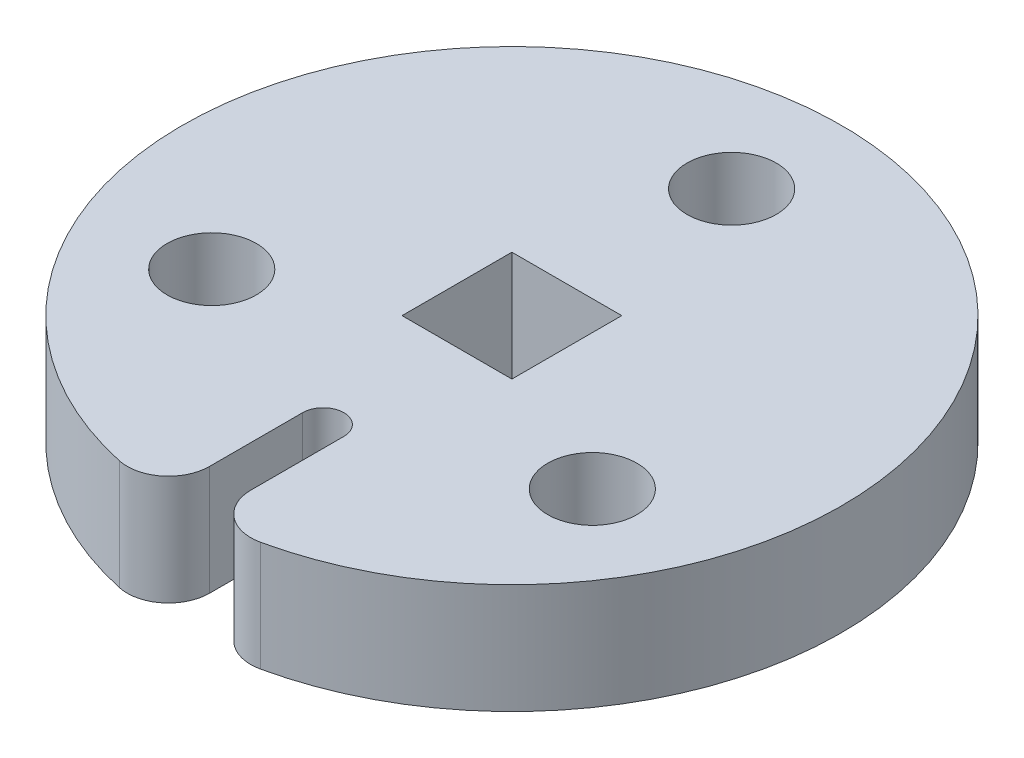
ISO-10303-21;
HEADER;
FILE_DESCRIPTION(('STEP AP214'),'2;1');
FILE_NAME('part.step','',(''),(''),'','','');
FILE_SCHEMA(('AUTOMOTIVE_DESIGN { 1 0 10303 214 1 1 1 1 }'));
ENDSEC;
DATA;
#1=APPLICATION_CONTEXT('core data for automotive mechanical design processes');
#2=APPLICATION_PROTOCOL_DEFINITION('international standard','automotive_design',2000,#1);
#3=PRODUCT_CONTEXT('',#1,'mechanical');
#4=PRODUCT('Part','Part','',(#3));
#5=PRODUCT_RELATED_PRODUCT_CATEGORY('part','',(#4));
#6=PRODUCT_DEFINITION_FORMATION('','',#4);
#7=PRODUCT_DEFINITION_CONTEXT('part definition',#1,'design');
#8=PRODUCT_DEFINITION('design','',#6,#7);
#9=PRODUCT_DEFINITION_SHAPE('','',#8);
#10=(LENGTH_UNIT() NAMED_UNIT(*) SI_UNIT(.MILLI.,.METRE.));
#11=(NAMED_UNIT(*) PLANE_ANGLE_UNIT() SI_UNIT($,.RADIAN.));
#12=(NAMED_UNIT(*) SI_UNIT($,.STERADIAN.) SOLID_ANGLE_UNIT());
#13=UNCERTAINTY_MEASURE_WITH_UNIT(LENGTH_MEASURE(1.E-05),#10,'distance_accuracy_value','');
#14=(GEOMETRIC_REPRESENTATION_CONTEXT(3) GLOBAL_UNCERTAINTY_ASSIGNED_CONTEXT((#13)) GLOBAL_UNIT_ASSIGNED_CONTEXT((#10,
#11,#12)) REPRESENTATION_CONTEXT('',''));
#15=CARTESIAN_POINT('',(0.,0.,0.));
#16=DIRECTION('',(0.,0.,1.));
#17=DIRECTION('',(1.,0.,0.));
#18=AXIS2_PLACEMENT_3D('',#15,#16,#17);
#19=CARTESIAN_POINT('',(0.,6.35,10.903378281309));
#20=DIRECTION('',(0.,1.,0.));
#21=DIRECTION('',(0.,0.,1.));
#22=AXIS2_PLACEMENT_3D('',#19,#20,#21);
#23=PLANE('',#22);
#24=CARTESIAN_POINT('',(10.9985226280624,6.35,6.35));
#25=DIRECTION('',(0.,1.,0.));
#26=DIRECTION('',(0.,0.,1.));
#27=AXIS2_PLACEMENT_3D('',#24,#25,#26);
#28=CIRCLE('',#27,2.5796875);
#29=CARTESIAN_POINT('',(10.9985226280624,6.35,8.9296875));
#30=VERTEX_POINT('',#29);
#31=EDGE_CURVE('E139',#30,#30,#28,.T.);
#32=ORIENTED_EDGE('',*,*,#31,.F.);
#33=EDGE_LOOP('',(#32));
#34=FACE_BOUND('',#33,.T.);
#35=CARTESIAN_POINT('',(0.,6.35,10.903378281309));
#36=DIRECTION('',(0.,-1.,0.));
#37=DIRECTION('',(0.,0.,1.));
#38=AXIS2_PLACEMENT_3D('',#35,#36,#37);
#39=CIRCLE('',#38,1.190625);
#40=CARTESIAN_POINT('',(-1.190625,6.35,10.903378281309));
#41=VERTEX_POINT('',#40);
#42=CARTESIAN_POINT('',(1.190625,6.35,10.903378281309));
#43=VERTEX_POINT('',#42);
#44=EDGE_CURVE('E155',#41,#43,#39,.T.);
#45=ORIENTED_EDGE('',*,*,#44,.T.);
#46=DIRECTION('',(0.,0.,1.));
#47=VECTOR('',#46,1.);
#48=CARTESIAN_POINT('',(1.190625,6.35,10.903378281309));
#49=LINE('',#48,#47);
#50=CARTESIAN_POINT('',(1.190625,6.35,16.281552000558));
#51=VERTEX_POINT('',#50);
#52=EDGE_CURVE('E158',#43,#51,#49,.T.);
#53=ORIENTED_EDGE('',*,*,#52,.T.);
#54=CARTESIAN_POINT('',(3.571875,6.35,16.281552000558));
#55=DIRECTION('',(0.,1.,0.));
#56=DIRECTION('',(0.,0.,1.));
#57=AXIS2_PLACEMENT_3D('',#54,#55,#56);
#58=CIRCLE('',#57,2.38125);
#59=CARTESIAN_POINT('',(4.08214285714286,6.35,18.6074880006377));
#60=VERTEX_POINT('',#59);
#61=EDGE_CURVE('E161',#51,#60,#58,.T.);
#62=ORIENTED_EDGE('',*,*,#61,.T.);
#63=CARTESIAN_POINT('',(0.,6.35,0.));
#64=DIRECTION('',(0.,1.,0.));
#65=DIRECTION('',(0.,0.,1.));
#66=AXIS2_PLACEMENT_3D('',#63,#64,#65);
#67=CIRCLE('',#66,19.05);
#68=CARTESIAN_POINT('',(-4.08214285714286,6.35,18.6074880006377));
#69=VERTEX_POINT('',#68);
#70=EDGE_CURVE('E163',#60,#69,#67,.T.);
#71=ORIENTED_EDGE('',*,*,#70,.T.);
#72=CARTESIAN_POINT('',(-3.571875,6.35,16.281552000558));
#73=DIRECTION('',(0.,1.,0.));
#74=DIRECTION('',(0.,0.,-1.));
#75=AXIS2_PLACEMENT_3D('',#72,#73,#74);
#76=CIRCLE('',#75,2.38125);
#77=CARTESIAN_POINT('',(-1.190625,6.35,16.281552000558));
#78=VERTEX_POINT('',#77);
#79=EDGE_CURVE('E165',#69,#78,#76,.T.);
#80=ORIENTED_EDGE('',*,*,#79,.T.);
#81=DIRECTION('',(0.,0.,-1.));
#82=VECTOR('',#81,1.);
#83=CARTESIAN_POINT('',(-1.190625,6.35,10.903378281309));
#84=LINE('',#83,#82);
#85=EDGE_CURVE('E167',#78,#41,#84,.T.);
#86=ORIENTED_EDGE('',*,*,#85,.T.);
#87=EDGE_LOOP('',(#45,#53,#62,#71,#80,#86));
#88=FACE_BOUND('',#87,.T.);
#89=CARTESIAN_POINT('',(0.,6.35,-12.7));
#90=DIRECTION('',(0.,1.,0.));
#91=DIRECTION('',(0.,0.,1.));
#92=AXIS2_PLACEMENT_3D('',#89,#90,#91);
#93=CIRCLE('',#92,2.5796875);
#94=CARTESIAN_POINT('',(0.,6.35,-10.1203125));
#95=VERTEX_POINT('',#94);
#96=EDGE_CURVE('E149',#95,#95,#93,.T.);
#97=ORIENTED_EDGE('',*,*,#96,.F.);
#98=EDGE_LOOP('',(#97));
#99=FACE_BOUND('',#98,.T.);
#100=DIRECTION('',(-1.,0.,0.));
#101=VECTOR('',#100,1.);
#102=CARTESIAN_POINT('',(3.175,6.35,-3.175));
#103=LINE('',#102,#101);
#104=CARTESIAN_POINT('',(3.175,6.35,-3.175));
#105=VERTEX_POINT('',#104);
#106=CARTESIAN_POINT('',(-3.175,6.35,-3.175));
#107=VERTEX_POINT('',#106);
#108=EDGE_CURVE('E118',#105,#107,#103,.T.);
#109=ORIENTED_EDGE('',*,*,#108,.F.);
#110=DIRECTION('',(0.,0.,-1.));
#111=VECTOR('',#110,1.);
#112=CARTESIAN_POINT('',(3.175,6.35,3.175));
#113=LINE('',#112,#111);
#114=CARTESIAN_POINT('',(3.175,6.35,3.175));
#115=VERTEX_POINT('',#114);
#116=EDGE_CURVE('E110',#115,#105,#113,.T.);
#117=ORIENTED_EDGE('',*,*,#116,.F.);
#118=DIRECTION('',(1.,0.,0.));
#119=VECTOR('',#118,1.);
#120=CARTESIAN_POINT('',(3.175,6.35,3.175));
#121=LINE('',#120,#119);
#122=CARTESIAN_POINT('',(-3.175,6.35,3.175));
#123=VERTEX_POINT('',#122);
#124=EDGE_CURVE('E133',#123,#115,#121,.T.);
#125=ORIENTED_EDGE('',*,*,#124,.F.);
#126=DIRECTION('',(0.,0.,1.));
#127=VECTOR('',#126,1.);
#128=CARTESIAN_POINT('',(-3.175,6.35,3.175));
#129=LINE('',#128,#127);
#130=EDGE_CURVE('E131',#107,#123,#129,.T.);
#131=ORIENTED_EDGE('',*,*,#130,.F.);
#132=EDGE_LOOP('',(#109,#117,#125,#131));
#133=FACE_BOUND('',#132,.T.);
#134=CARTESIAN_POINT('',(-10.9985226280624,6.35,6.35000000000001));
#135=DIRECTION('',(0.,1.,0.));
#136=DIRECTION('',(0.,0.,1.));
#137=AXIS2_PLACEMENT_3D('',#134,#135,#136);
#138=CIRCLE('',#137,2.5796875);
#139=CARTESIAN_POINT('',(-10.9985226280624,6.35,8.92968750000001));
#140=VERTEX_POINT('',#139);
#141=EDGE_CURVE('E267',#140,#140,#138,.T.);
#142=ORIENTED_EDGE('',*,*,#141,.F.);
#143=EDGE_LOOP('',(#142));
#144=FACE_BOUND('',#143,.T.);
#145=ADVANCED_FACE('F33',(#34,#88,#99,#133,#144),#23,.T.);
#146=CARTESIAN_POINT('',(0.,0.,10.903378281309));
#147=DIRECTION('',(0.,1.,0.));
#148=DIRECTION('',(0.,0.,1.));
#149=AXIS2_PLACEMENT_3D('',#146,#147,#148);
#150=PLANE('',#149);
#151=CARTESIAN_POINT('',(0.,0.,-12.7));
#152=DIRECTION('',(0.,1.,0.));
#153=DIRECTION('',(0.,0.,1.));
#154=AXIS2_PLACEMENT_3D('',#151,#152,#153);
#155=CIRCLE('',#154,2.5796875);
#156=CARTESIAN_POINT('',(0.,0.,-10.1203125));
#157=VERTEX_POINT('',#156);
#158=EDGE_CURVE('E126',#157,#157,#155,.T.);
#159=ORIENTED_EDGE('',*,*,#158,.T.);
#160=EDGE_LOOP('',(#159));
#161=FACE_BOUND('',#160,.T.);
#162=CARTESIAN_POINT('',(0.,0.,10.903378281309));
#163=DIRECTION('',(0.,-1.,0.));
#164=DIRECTION('',(0.,0.,1.));
#165=AXIS2_PLACEMENT_3D('',#162,#163,#164);
#166=CIRCLE('',#165,1.190625);
#167=CARTESIAN_POINT('',(-1.190625,0.,10.903378281309));
#168=VERTEX_POINT('',#167);
#169=CARTESIAN_POINT('',(1.190625,0.,10.903378281309));
#170=VERTEX_POINT('',#169);
#171=EDGE_CURVE('E152',#168,#170,#166,.T.);
#172=ORIENTED_EDGE('',*,*,#171,.F.);
#173=DIRECTION('',(0.,0.,-1.));
#174=VECTOR('',#173,1.);
#175=CARTESIAN_POINT('',(-1.190625,0.,10.903378281309));
#176=LINE('',#175,#174);
#177=CARTESIAN_POINT('',(-1.190625,0.,16.281552000558));
#178=VERTEX_POINT('',#177);
#179=EDGE_CURVE('E159',#178,#168,#176,.T.);
#180=ORIENTED_EDGE('',*,*,#179,.F.);
#181=CARTESIAN_POINT('',(-3.571875,0.,16.281552000558));
#182=DIRECTION('',(0.,1.,0.));
#183=DIRECTION('',(0.,0.,-1.));
#184=AXIS2_PLACEMENT_3D('',#181,#182,#183);
#185=CIRCLE('',#184,2.38125);
#186=CARTESIAN_POINT('',(-4.08214285714286,0.,18.6074880006377));
#187=VERTEX_POINT('',#186);
#188=EDGE_CURVE('E178',#187,#178,#185,.T.);
#189=ORIENTED_EDGE('',*,*,#188,.F.);
#190=CARTESIAN_POINT('',(0.,0.,0.));
#191=DIRECTION('',(0.,1.,0.));
#192=DIRECTION('',(0.,0.,1.));
#193=AXIS2_PLACEMENT_3D('',#190,#191,#192);
#194=CIRCLE('',#193,19.05);
#195=CARTESIAN_POINT('',(4.08214285714286,0.,18.6074880006377));
#196=VERTEX_POINT('',#195);
#197=EDGE_CURVE('E176',#196,#187,#194,.T.);
#198=ORIENTED_EDGE('',*,*,#197,.F.);
#199=CARTESIAN_POINT('',(3.571875,0.,16.281552000558));
#200=DIRECTION('',(0.,1.,0.));
#201=DIRECTION('',(0.,0.,1.));
#202=AXIS2_PLACEMENT_3D('',#199,#200,#201);
#203=CIRCLE('',#202,2.38125);
#204=CARTESIAN_POINT('',(1.190625,0.,16.281552000558));
#205=VERTEX_POINT('',#204);
#206=EDGE_CURVE('E174',#205,#196,#203,.T.);
#207=ORIENTED_EDGE('',*,*,#206,.F.);
#208=DIRECTION('',(0.,0.,1.));
#209=VECTOR('',#208,1.);
#210=CARTESIAN_POINT('',(1.190625,0.,10.903378281309));
#211=LINE('',#210,#209);
#212=EDGE_CURVE('E172',#170,#205,#211,.T.);
#213=ORIENTED_EDGE('',*,*,#212,.F.);
#214=EDGE_LOOP('',(#172,#180,#189,#198,#207,#213));
#215=FACE_BOUND('',#214,.T.);
#216=DIRECTION('',(0.,0.,-1.));
#217=VECTOR('',#216,1.);
#218=CARTESIAN_POINT('',(3.175,0.,3.175));
#219=LINE('',#218,#217);
#220=CARTESIAN_POINT('',(3.175,0.,3.175));
#221=VERTEX_POINT('',#220);
#222=CARTESIAN_POINT('',(3.175,0.,-3.175));
#223=VERTEX_POINT('',#222);
#224=EDGE_CURVE('E56',#221,#223,#219,.T.);
#225=ORIENTED_EDGE('',*,*,#224,.T.);
#226=DIRECTION('',(-1.,0.,0.));
#227=VECTOR('',#226,1.);
#228=CARTESIAN_POINT('',(3.175,0.,-3.175));
#229=LINE('',#228,#227);
#230=CARTESIAN_POINT('',(-3.175,0.,-3.175));
#231=VERTEX_POINT('',#230);
#232=EDGE_CURVE('E125',#223,#231,#229,.T.);
#233=ORIENTED_EDGE('',*,*,#232,.T.);
#234=DIRECTION('',(0.,0.,1.));
#235=VECTOR('',#234,1.);
#236=CARTESIAN_POINT('',(-3.175,0.,3.175));
#237=LINE('',#236,#235);
#238=CARTESIAN_POINT('',(-3.175,0.,3.175));
#239=VERTEX_POINT('',#238);
#240=EDGE_CURVE('E141',#231,#239,#237,.T.);
#241=ORIENTED_EDGE('',*,*,#240,.T.);
#242=DIRECTION('',(1.,0.,0.));
#243=VECTOR('',#242,1.);
#244=CARTESIAN_POINT('',(3.175,0.,3.175));
#245=LINE('',#244,#243);
#246=EDGE_CURVE('E119',#239,#221,#245,.T.);
#247=ORIENTED_EDGE('',*,*,#246,.T.);
#248=EDGE_LOOP('',(#225,#233,#241,#247));
#249=FACE_BOUND('',#248,.T.);
#250=CARTESIAN_POINT('',(10.9985226280624,0.,6.35));
#251=DIRECTION('',(0.,1.,0.));
#252=DIRECTION('',(0.,0.,1.));
#253=AXIS2_PLACEMENT_3D('',#250,#251,#252);
#254=CIRCLE('',#253,2.5796875);
#255=CARTESIAN_POINT('',(10.9985226280624,0.,8.9296875));
#256=VERTEX_POINT('',#255);
#257=EDGE_CURVE('E273',#256,#256,#254,.T.);
#258=ORIENTED_EDGE('',*,*,#257,.T.);
#259=EDGE_LOOP('',(#258));
#260=FACE_BOUND('',#259,.T.);
#261=CARTESIAN_POINT('',(-10.9985226280624,0.,6.35000000000001));
#262=DIRECTION('',(0.,1.,0.));
#263=DIRECTION('',(0.,0.,1.));
#264=AXIS2_PLACEMENT_3D('',#261,#262,#263);
#265=CIRCLE('',#264,2.5796875);
#266=CARTESIAN_POINT('',(-10.9985226280624,0.,8.92968750000001));
#267=VERTEX_POINT('',#266);
#268=EDGE_CURVE('E270',#267,#267,#265,.T.);
#269=ORIENTED_EDGE('',*,*,#268,.T.);
#270=EDGE_LOOP('',(#269));
#271=FACE_BOUND('',#270,.T.);
#272=ADVANCED_FACE('F202',(#161,#215,#249,#260,#271),#150,.F.);
#273=CARTESIAN_POINT('',(0.,6.35,10.903378281309));
#274=DIRECTION('',(0.,-1.,0.));
#275=DIRECTION('',(0.,0.,-1.));
#276=AXIS2_PLACEMENT_3D('',#273,#274,#275);
#277=CYLINDRICAL_SURFACE('',#276,1.190625);
#278=ORIENTED_EDGE('',*,*,#171,.T.);
#279=DIRECTION('',(0.,-1.,0.));
#280=VECTOR('',#279,1.);
#281=CARTESIAN_POINT('',(1.190625,6.35,10.903378281309));
#282=LINE('',#281,#280);
#283=EDGE_CURVE('E11',#43,#170,#282,.T.);
#284=ORIENTED_EDGE('',*,*,#283,.F.);
#285=ORIENTED_EDGE('',*,*,#44,.F.);
#286=DIRECTION('',(0.,-1.,0.));
#287=VECTOR('',#286,1.);
#288=CARTESIAN_POINT('',(-1.190625,6.35,10.903378281309));
#289=LINE('',#288,#287);
#290=EDGE_CURVE('E169',#41,#168,#289,.T.);
#291=ORIENTED_EDGE('',*,*,#290,.T.);
#292=EDGE_LOOP('',(#278,#284,#285,#291));
#293=FACE_BOUND('',#292,.T.);
#294=ADVANCED_FACE('F35',(#293),#277,.F.);
#295=CARTESIAN_POINT('',(1.190625,6.35,10.903378281309));
#296=DIRECTION('',(1.,0.,0.));
#297=DIRECTION('',(0.,0.,-1.));
#298=AXIS2_PLACEMENT_3D('',#295,#296,#297);
#299=PLANE('',#298);
#300=ORIENTED_EDGE('',*,*,#212,.T.);
#301=DIRECTION('',(0.,-1.,0.));
#302=VECTOR('',#301,1.);
#303=CARTESIAN_POINT('',(1.190625,6.35,16.281552000558));
#304=LINE('',#303,#302);
#305=EDGE_CURVE('E41',#51,#205,#304,.T.);
#306=ORIENTED_EDGE('',*,*,#305,.F.);
#307=ORIENTED_EDGE('',*,*,#52,.F.);
#308=ORIENTED_EDGE('',*,*,#283,.T.);
#309=EDGE_LOOP('',(#300,#306,#307,#308));
#310=FACE_BOUND('',#309,.T.);
#311=ADVANCED_FACE('F220',(#310),#299,.F.);
#312=CARTESIAN_POINT('',(3.571875,6.35,16.281552000558));
#313=DIRECTION('',(0.,-1.,0.));
#314=DIRECTION('',(0.,0.,-1.));
#315=AXIS2_PLACEMENT_3D('',#312,#313,#314);
#316=CYLINDRICAL_SURFACE('',#315,2.38125);
#317=ORIENTED_EDGE('',*,*,#206,.T.);
#318=DIRECTION('',(0.,-1.,0.));
#319=VECTOR('',#318,1.);
#320=CARTESIAN_POINT('',(4.08214285714286,6.35,18.6074880006377));
#321=LINE('',#320,#319);
#322=EDGE_CURVE('E189',#60,#196,#321,.T.);
#323=ORIENTED_EDGE('',*,*,#322,.F.);
#324=ORIENTED_EDGE('',*,*,#61,.F.);
#325=ORIENTED_EDGE('',*,*,#305,.T.);
#326=EDGE_LOOP('',(#317,#323,#324,#325));
#327=FACE_BOUND('',#326,.T.);
#328=ADVANCED_FACE('F196',(#327),#316,.T.);
#329=CARTESIAN_POINT('',(0.,6.35,0.));
#330=DIRECTION('',(0.,-1.,0.));
#331=DIRECTION('',(0.,0.,-1.));
#332=AXIS2_PLACEMENT_3D('',#329,#330,#331);
#333=CYLINDRICAL_SURFACE('',#332,19.05);
#334=ORIENTED_EDGE('',*,*,#197,.T.);
#335=DIRECTION('',(0.,-1.,0.));
#336=VECTOR('',#335,1.);
#337=CARTESIAN_POINT('',(-4.08214285714286,6.35,18.6074880006377));
#338=LINE('',#337,#336);
#339=EDGE_CURVE('E186',#69,#187,#338,.T.);
#340=ORIENTED_EDGE('',*,*,#339,.F.);
#341=ORIENTED_EDGE('',*,*,#70,.F.);
#342=ORIENTED_EDGE('',*,*,#322,.T.);
#343=EDGE_LOOP('',(#334,#340,#341,#342));
#344=FACE_BOUND('',#343,.T.);
#345=ADVANCED_FACE('F208',(#344),#333,.T.);
#346=CARTESIAN_POINT('',(-3.571875,6.35,16.281552000558));
#347=DIRECTION('',(0.,-1.,0.));
#348=DIRECTION('',(0.,0.,-1.));
#349=AXIS2_PLACEMENT_3D('',#346,#347,#348);
#350=CYLINDRICAL_SURFACE('',#349,2.38125);
#351=ORIENTED_EDGE('',*,*,#188,.T.);
#352=DIRECTION('',(0.,-1.,0.));
#353=VECTOR('',#352,1.);
#354=CARTESIAN_POINT('',(-1.190625,6.35,16.281552000558));
#355=LINE('',#354,#353);
#356=EDGE_CURVE('E183',#78,#178,#355,.T.);
#357=ORIENTED_EDGE('',*,*,#356,.F.);
#358=ORIENTED_EDGE('',*,*,#79,.F.);
#359=ORIENTED_EDGE('',*,*,#339,.T.);
#360=EDGE_LOOP('',(#351,#357,#358,#359));
#361=FACE_BOUND('',#360,.T.);
#362=ADVANCED_FACE('F212',(#361),#350,.T.);
#363=CARTESIAN_POINT('',(-1.190625,6.35,10.903378281309));
#364=DIRECTION('',(-1.,0.,0.));
#365=DIRECTION('',(0.,0.,1.));
#366=AXIS2_PLACEMENT_3D('',#363,#364,#365);
#367=PLANE('',#366);
#368=ORIENTED_EDGE('',*,*,#179,.T.);
#369=ORIENTED_EDGE('',*,*,#290,.F.);
#370=ORIENTED_EDGE('',*,*,#85,.F.);
#371=ORIENTED_EDGE('',*,*,#356,.T.);
#372=EDGE_LOOP('',(#368,#369,#370,#371));
#373=FACE_BOUND('',#372,.T.);
#374=ADVANCED_FACE('F223',(#373),#367,.F.);
#375=CARTESIAN_POINT('',(0.,6.35,-12.7));
#376=DIRECTION('',(0.,-1.,0.));
#377=DIRECTION('',(0.,0.,-1.));
#378=AXIS2_PLACEMENT_3D('',#375,#376,#377);
#379=CYLINDRICAL_SURFACE('',#378,2.5796875);
#380=ORIENTED_EDGE('',*,*,#96,.T.);
#381=EDGE_LOOP('',(#380));
#382=FACE_BOUND('',#381,.T.);
#383=ORIENTED_EDGE('',*,*,#158,.F.);
#384=EDGE_LOOP('',(#383));
#385=FACE_BOUND('',#384,.T.);
#386=ADVANCED_FACE('F225',(#382,#385),#379,.F.);
#387=CARTESIAN_POINT('',(3.175,6.35,3.175));
#388=DIRECTION('',(-1.,0.,0.));
#389=DIRECTION('',(0.,0.,1.));
#390=AXIS2_PLACEMENT_3D('',#387,#388,#389);
#391=PLANE('',#390);
#392=ORIENTED_EDGE('',*,*,#224,.F.);
#393=DIRECTION('',(0.,-1.,0.));
#394=VECTOR('',#393,1.);
#395=CARTESIAN_POINT('',(3.175,6.35,3.175));
#396=LINE('',#395,#394);
#397=EDGE_CURVE('E114',#115,#221,#396,.T.);
#398=ORIENTED_EDGE('',*,*,#397,.F.);
#399=ORIENTED_EDGE('',*,*,#116,.T.);
#400=DIRECTION('',(0.,-1.,0.));
#401=VECTOR('',#400,1.);
#402=CARTESIAN_POINT('',(3.175,6.35,-3.175));
#403=LINE('',#402,#401);
#404=EDGE_CURVE('E113',#105,#223,#403,.T.);
#405=ORIENTED_EDGE('',*,*,#404,.T.);
#406=EDGE_LOOP('',(#392,#398,#399,#405));
#407=FACE_BOUND('',#406,.T.);
#408=ADVANCED_FACE('F112',(#407),#391,.T.);
#409=CARTESIAN_POINT('',(3.175,6.35,-3.175));
#410=DIRECTION('',(0.,0.,1.));
#411=DIRECTION('',(1.,0.,0.));
#412=AXIS2_PLACEMENT_3D('',#409,#410,#411);
#413=PLANE('',#412);
#414=ORIENTED_EDGE('',*,*,#232,.F.);
#415=ORIENTED_EDGE('',*,*,#404,.F.);
#416=ORIENTED_EDGE('',*,*,#108,.T.);
#417=DIRECTION('',(0.,-1.,0.));
#418=VECTOR('',#417,1.);
#419=CARTESIAN_POINT('',(-3.175,6.35,-3.175));
#420=LINE('',#419,#418);
#421=EDGE_CURVE('E127',#107,#231,#420,.T.);
#422=ORIENTED_EDGE('',*,*,#421,.T.);
#423=EDGE_LOOP('',(#414,#415,#416,#422));
#424=FACE_BOUND('',#423,.T.);
#425=ADVANCED_FACE('F122',(#424),#413,.T.);
#426=CARTESIAN_POINT('',(-3.175,6.35,3.175));
#427=DIRECTION('',(1.,0.,0.));
#428=DIRECTION('',(0.,0.,-1.));
#429=AXIS2_PLACEMENT_3D('',#426,#427,#428);
#430=PLANE('',#429);
#431=ORIENTED_EDGE('',*,*,#240,.F.);
#432=ORIENTED_EDGE('',*,*,#421,.F.);
#433=ORIENTED_EDGE('',*,*,#130,.T.);
#434=DIRECTION('',(0.,-1.,0.));
#435=VECTOR('',#434,1.);
#436=CARTESIAN_POINT('',(-3.175,6.35,3.175));
#437=LINE('',#436,#435);
#438=EDGE_CURVE('E48',#123,#239,#437,.T.);
#439=ORIENTED_EDGE('',*,*,#438,.T.);
#440=EDGE_LOOP('',(#431,#432,#433,#439));
#441=FACE_BOUND('',#440,.T.);
#442=ADVANCED_FACE('F248',(#441),#430,.T.);
#443=CARTESIAN_POINT('',(3.175,6.35,3.175));
#444=DIRECTION('',(0.,0.,-1.));
#445=DIRECTION('',(-1.,0.,0.));
#446=AXIS2_PLACEMENT_3D('',#443,#444,#445);
#447=PLANE('',#446);
#448=ORIENTED_EDGE('',*,*,#246,.F.);
#449=ORIENTED_EDGE('',*,*,#438,.F.);
#450=ORIENTED_EDGE('',*,*,#124,.T.);
#451=ORIENTED_EDGE('',*,*,#397,.T.);
#452=EDGE_LOOP('',(#448,#449,#450,#451));
#453=FACE_BOUND('',#452,.T.);
#454=ADVANCED_FACE('F251',(#453),#447,.T.);
#455=CARTESIAN_POINT('',(10.9985226280624,6.35,6.35));
#456=DIRECTION('',(0.,-1.,0.));
#457=DIRECTION('',(0.,0.,-1.));
#458=AXIS2_PLACEMENT_3D('',#455,#456,#457);
#459=CYLINDRICAL_SURFACE('',#458,2.5796875);
#460=ORIENTED_EDGE('',*,*,#31,.T.);
#461=EDGE_LOOP('',(#460));
#462=FACE_BOUND('',#461,.T.);
#463=ORIENTED_EDGE('',*,*,#257,.F.);
#464=EDGE_LOOP('',(#463));
#465=FACE_BOUND('',#464,.T.);
#466=ADVANCED_FACE('F255',(#462,#465),#459,.F.);
#467=CARTESIAN_POINT('',(-10.9985226280624,6.35,6.35000000000001));
#468=DIRECTION('',(0.,-1.,0.));
#469=DIRECTION('',(0.,0.,-1.));
#470=AXIS2_PLACEMENT_3D('',#467,#468,#469);
#471=CYLINDRICAL_SURFACE('',#470,2.5796875);
#472=ORIENTED_EDGE('',*,*,#141,.T.);
#473=EDGE_LOOP('',(#472));
#474=FACE_BOUND('',#473,.T.);
#475=ORIENTED_EDGE('',*,*,#268,.F.);
#476=EDGE_LOOP('',(#475));
#477=FACE_BOUND('',#476,.T.);
#478=ADVANCED_FACE('F258',(#474,#477),#471,.F.);
#479=CLOSED_SHELL('',(#145,#272,#294,#311,#328,#345,#362,#374,#386,#408,#425,#442,#454,#466,#478));
#480=MANIFOLD_SOLID_BREP('B2',#479);
#481=ADVANCED_BREP_SHAPE_REPRESENTATION('',(#18,#480),#14);
#482=SHAPE_DEFINITION_REPRESENTATION(#9,#481);
ENDSEC;
END-ISO-10303-21;
